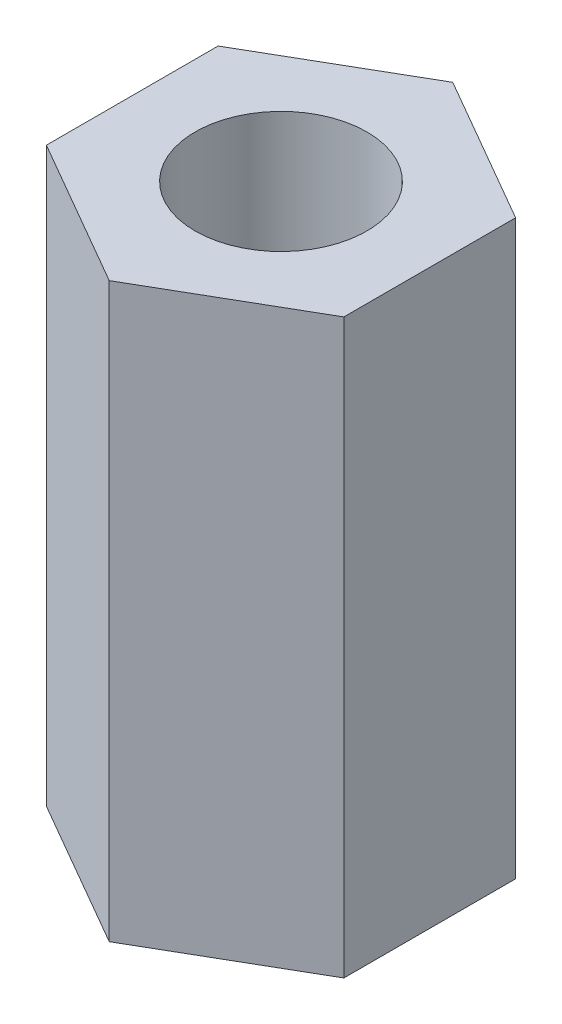
ISO-10303-21;
HEADER;
FILE_DESCRIPTION(('STEP AP214'),'2;1');
FILE_NAME('part.step','',(''),(''),'','','');
FILE_SCHEMA(('AUTOMOTIVE_DESIGN { 1 0 10303 214 1 1 1 1 }'));
ENDSEC;
DATA;
#1=APPLICATION_CONTEXT('core data for automotive mechanical design processes');
#2=APPLICATION_PROTOCOL_DEFINITION('international standard','automotive_design',2000,#1);
#3=PRODUCT_CONTEXT('',#1,'mechanical');
#4=PRODUCT('Part','Part','',(#3));
#5=PRODUCT_RELATED_PRODUCT_CATEGORY('part','',(#4));
#6=PRODUCT_DEFINITION_FORMATION('','',#4);
#7=PRODUCT_DEFINITION_CONTEXT('part definition',#1,'design');
#8=PRODUCT_DEFINITION('design','',#6,#7);
#9=PRODUCT_DEFINITION_SHAPE('','',#8);
#10=(LENGTH_UNIT() NAMED_UNIT(*) SI_UNIT(.MILLI.,.METRE.));
#11=(NAMED_UNIT(*) PLANE_ANGLE_UNIT() SI_UNIT($,.RADIAN.));
#12=(NAMED_UNIT(*) SI_UNIT($,.STERADIAN.) SOLID_ANGLE_UNIT());
#13=UNCERTAINTY_MEASURE_WITH_UNIT(LENGTH_MEASURE(1.E-05),#10,'distance_accuracy_value','');
#14=(GEOMETRIC_REPRESENTATION_CONTEXT(3) GLOBAL_UNCERTAINTY_ASSIGNED_CONTEXT((#13)) GLOBAL_UNIT_ASSIGNED_CONTEXT((#10,
#11,#12)) REPRESENTATION_CONTEXT('',''));
#15=CARTESIAN_POINT('',(0.,0.,0.));
#16=DIRECTION('',(0.,0.,1.));
#17=DIRECTION('',(1.,0.,0.));
#18=AXIS2_PLACEMENT_3D('',#15,#16,#17);
#19=CARTESIAN_POINT('',(0.,10.,-3.));
#20=DIRECTION('',(0.,1.,0.));
#21=DIRECTION('',(0.,0.,1.));
#22=AXIS2_PLACEMENT_3D('',#19,#20,#21);
#23=PLANE('',#22);
#24=DIRECTION('',(-0.866025403784439,0.,-0.5));
#25=VECTOR('',#24,1.);
#26=CARTESIAN_POINT('',(2.59807621135332,10.,-1.5));
#27=LINE('',#26,#25);
#28=CARTESIAN_POINT('',(2.59807621135332,10.,-1.5));
#29=VERTEX_POINT('',#28);
#30=CARTESIAN_POINT('',(0.,10.,-3.));
#31=VERTEX_POINT('',#30);
#32=EDGE_CURVE('E127',#29,#31,#27,.T.);
#33=ORIENTED_EDGE('',*,*,#32,.T.);
#34=DIRECTION('',(-0.866025403784439,0.,0.5));
#35=VECTOR('',#34,1.);
#36=CARTESIAN_POINT('',(0.,10.,-3.));
#37=LINE('',#36,#35);
#38=CARTESIAN_POINT('',(-2.59807621135332,10.,-1.5));
#39=VERTEX_POINT('',#38);
#40=EDGE_CURVE('E85',#31,#39,#37,.T.);
#41=ORIENTED_EDGE('',*,*,#40,.T.);
#42=DIRECTION('',(0.,0.,1.));
#43=VECTOR('',#42,1.);
#44=CARTESIAN_POINT('',(-2.59807621135332,10.,-1.5));
#45=LINE('',#44,#43);
#46=CARTESIAN_POINT('',(-2.59807621135332,10.,1.5));
#47=VERTEX_POINT('',#46);
#48=EDGE_CURVE('E98',#39,#47,#45,.T.);
#49=ORIENTED_EDGE('',*,*,#48,.T.);
#50=DIRECTION('',(0.866025403784439,0.,0.5));
#51=VECTOR('',#50,1.);
#52=CARTESIAN_POINT('',(-2.59807621135332,10.,1.5));
#53=LINE('',#52,#51);
#54=CARTESIAN_POINT('',(0.,10.,3.));
#55=VERTEX_POINT('',#54);
#56=EDGE_CURVE('E92',#47,#55,#53,.T.);
#57=ORIENTED_EDGE('',*,*,#56,.T.);
#58=DIRECTION('',(0.866025403784439,0.,-0.5));
#59=VECTOR('',#58,1.);
#60=CARTESIAN_POINT('',(0.,10.,3.));
#61=LINE('',#60,#59);
#62=CARTESIAN_POINT('',(2.59807621135332,10.,1.5));
#63=VERTEX_POINT('',#62);
#64=EDGE_CURVE('E96',#55,#63,#61,.T.);
#65=ORIENTED_EDGE('',*,*,#64,.T.);
#66=DIRECTION('',(0.,0.,-1.));
#67=VECTOR('',#66,1.);
#68=CARTESIAN_POINT('',(2.59807621135332,10.,1.5));
#69=LINE('',#68,#67);
#70=EDGE_CURVE('E48',#63,#29,#69,.T.);
#71=ORIENTED_EDGE('',*,*,#70,.T.);
#72=EDGE_LOOP('',(#33,#41,#49,#57,#65,#71));
#73=FACE_BOUND('',#72,.T.);
#74=CARTESIAN_POINT('',(0.,10.,0.));
#75=DIRECTION('',(0.,1.,0.));
#76=DIRECTION('',(0.,0.,1.));
#77=AXIS2_PLACEMENT_3D('',#74,#75,#76);
#78=CIRCLE('',#77,1.5);
#79=CARTESIAN_POINT('',(0.,10.,1.5));
#80=VERTEX_POINT('',#79);
#81=EDGE_CURVE('E120',#80,#80,#78,.T.);
#82=ORIENTED_EDGE('',*,*,#81,.F.);
#83=EDGE_LOOP('',(#82));
#84=FACE_BOUND('',#83,.T.);
#85=ADVANCED_FACE('F31',(#73,#84),#23,.T.);
#86=CARTESIAN_POINT('',(0.,0.,-3.));
#87=DIRECTION('',(0.,1.,0.));
#88=DIRECTION('',(0.,0.,1.));
#89=AXIS2_PLACEMENT_3D('',#86,#87,#88);
#90=PLANE('',#89);
#91=DIRECTION('',(-0.866025403784439,0.,-0.5));
#92=VECTOR('',#91,1.);
#93=CARTESIAN_POINT('',(2.59807621135332,0.,-1.5));
#94=LINE('',#93,#92);
#95=CARTESIAN_POINT('',(2.59807621135332,0.,-1.5));
#96=VERTEX_POINT('',#95);
#97=CARTESIAN_POINT('',(0.,0.,-3.));
#98=VERTEX_POINT('',#97);
#99=EDGE_CURVE('E116',#96,#98,#94,.T.);
#100=ORIENTED_EDGE('',*,*,#99,.F.);
#101=DIRECTION('',(0.,0.,-1.));
#102=VECTOR('',#101,1.);
#103=CARTESIAN_POINT('',(2.59807621135332,0.,1.5));
#104=LINE('',#103,#102);
#105=CARTESIAN_POINT('',(2.59807621135332,0.,1.5));
#106=VERTEX_POINT('',#105);
#107=EDGE_CURVE('E77',#106,#96,#104,.T.);
#108=ORIENTED_EDGE('',*,*,#107,.F.);
#109=DIRECTION('',(0.866025403784439,0.,-0.5));
#110=VECTOR('',#109,1.);
#111=CARTESIAN_POINT('',(0.,0.,3.));
#112=LINE('',#111,#110);
#113=CARTESIAN_POINT('',(0.,0.,3.));
#114=VERTEX_POINT('',#113);
#115=EDGE_CURVE('E71',#114,#106,#112,.T.);
#116=ORIENTED_EDGE('',*,*,#115,.F.);
#117=DIRECTION('',(0.866025403784439,0.,0.5));
#118=VECTOR('',#117,1.);
#119=CARTESIAN_POINT('',(-2.59807621135332,0.,1.5));
#120=LINE('',#119,#118);
#121=CARTESIAN_POINT('',(-2.59807621135332,0.,1.5));
#122=VERTEX_POINT('',#121);
#123=EDGE_CURVE('E106',#122,#114,#120,.T.);
#124=ORIENTED_EDGE('',*,*,#123,.F.);
#125=DIRECTION('',(0.,0.,1.));
#126=VECTOR('',#125,1.);
#127=CARTESIAN_POINT('',(-2.59807621135332,0.,-1.5));
#128=LINE('',#127,#126);
#129=CARTESIAN_POINT('',(-2.59807621135332,0.,-1.5));
#130=VERTEX_POINT('',#129);
#131=EDGE_CURVE('E122',#130,#122,#128,.T.);
#132=ORIENTED_EDGE('',*,*,#131,.F.);
#133=DIRECTION('',(-0.866025403784439,0.,0.5));
#134=VECTOR('',#133,1.);
#135=CARTESIAN_POINT('',(0.,0.,-3.));
#136=LINE('',#135,#134);
#137=EDGE_CURVE('E119',#98,#130,#136,.T.);
#138=ORIENTED_EDGE('',*,*,#137,.F.);
#139=EDGE_LOOP('',(#100,#108,#116,#124,#132,#138));
#140=FACE_BOUND('',#139,.T.);
#141=CARTESIAN_POINT('',(0.,0.,0.));
#142=DIRECTION('',(0.,1.,0.));
#143=DIRECTION('',(0.,0.,1.));
#144=AXIS2_PLACEMENT_3D('',#141,#142,#143);
#145=CIRCLE('',#144,1.5);
#146=CARTESIAN_POINT('',(0.,0.,1.5));
#147=VERTEX_POINT('',#146);
#148=EDGE_CURVE('E220',#147,#147,#145,.T.);
#149=ORIENTED_EDGE('',*,*,#148,.T.);
#150=EDGE_LOOP('',(#149));
#151=FACE_BOUND('',#150,.T.);
#152=ADVANCED_FACE('F136',(#140,#151),#90,.F.);
#153=CARTESIAN_POINT('',(2.59807621135332,10.,-1.5));
#154=DIRECTION('',(-0.5,0.,0.866025403784439));
#155=DIRECTION('',(0.866025403784439,0.,0.5));
#156=AXIS2_PLACEMENT_3D('',#153,#154,#155);
#157=PLANE('',#156);
#158=ORIENTED_EDGE('',*,*,#99,.T.);
#159=DIRECTION('',(0.,-1.,0.));
#160=VECTOR('',#159,1.);
#161=CARTESIAN_POINT('',(0.,10.,-3.));
#162=LINE('',#161,#160);
#163=EDGE_CURVE('E11',#31,#98,#162,.T.);
#164=ORIENTED_EDGE('',*,*,#163,.F.);
#165=ORIENTED_EDGE('',*,*,#32,.F.);
#166=DIRECTION('',(0.,-1.,0.));
#167=VECTOR('',#166,1.);
#168=CARTESIAN_POINT('',(2.59807621135332,10.,-1.5));
#169=LINE('',#168,#167);
#170=EDGE_CURVE('E112',#29,#96,#169,.T.);
#171=ORIENTED_EDGE('',*,*,#170,.T.);
#172=EDGE_LOOP('',(#158,#164,#165,#171));
#173=FACE_BOUND('',#172,.T.);
#174=ADVANCED_FACE('F33',(#173),#157,.F.);
#175=CARTESIAN_POINT('',(0.,10.,-3.));
#176=DIRECTION('',(0.5,0.,0.866025403784439));
#177=DIRECTION('',(0.866025403784439,0.,-0.5));
#178=AXIS2_PLACEMENT_3D('',#175,#176,#177);
#179=PLANE('',#178);
#180=ORIENTED_EDGE('',*,*,#137,.T.);
#181=DIRECTION('',(0.,-1.,0.));
#182=VECTOR('',#181,1.);
#183=CARTESIAN_POINT('',(-2.59807621135332,10.,-1.5));
#184=LINE('',#183,#182);
#185=EDGE_CURVE('E40',#39,#130,#184,.T.);
#186=ORIENTED_EDGE('',*,*,#185,.F.);
#187=ORIENTED_EDGE('',*,*,#40,.F.);
#188=ORIENTED_EDGE('',*,*,#163,.T.);
#189=EDGE_LOOP('',(#180,#186,#187,#188));
#190=FACE_BOUND('',#189,.T.);
#191=ADVANCED_FACE('F161',(#190),#179,.F.);
#192=CARTESIAN_POINT('',(-2.59807621135332,10.,-1.5));
#193=DIRECTION('',(1.,0.,0.));
#194=DIRECTION('',(0.,0.,-1.));
#195=AXIS2_PLACEMENT_3D('',#192,#193,#194);
#196=PLANE('',#195);
#197=ORIENTED_EDGE('',*,*,#131,.T.);
#198=DIRECTION('',(0.,-1.,0.));
#199=VECTOR('',#198,1.);
#200=CARTESIAN_POINT('',(-2.59807621135332,10.,1.5));
#201=LINE('',#200,#199);
#202=EDGE_CURVE('E107',#47,#122,#201,.T.);
#203=ORIENTED_EDGE('',*,*,#202,.F.);
#204=ORIENTED_EDGE('',*,*,#48,.F.);
#205=ORIENTED_EDGE('',*,*,#185,.T.);
#206=EDGE_LOOP('',(#197,#203,#204,#205));
#207=FACE_BOUND('',#206,.T.);
#208=ADVANCED_FACE('F133',(#207),#196,.F.);
#209=CARTESIAN_POINT('',(-2.59807621135332,10.,1.5));
#210=DIRECTION('',(0.5,0.,-0.866025403784439));
#211=DIRECTION('',(-0.866025403784439,0.,-0.5));
#212=AXIS2_PLACEMENT_3D('',#209,#210,#211);
#213=PLANE('',#212);
#214=ORIENTED_EDGE('',*,*,#123,.T.);
#215=DIRECTION('',(0.,-1.,0.));
#216=VECTOR('',#215,1.);
#217=CARTESIAN_POINT('',(0.,10.,3.));
#218=LINE('',#217,#216);
#219=EDGE_CURVE('E103',#55,#114,#218,.T.);
#220=ORIENTED_EDGE('',*,*,#219,.F.);
#221=ORIENTED_EDGE('',*,*,#56,.F.);
#222=ORIENTED_EDGE('',*,*,#202,.T.);
#223=EDGE_LOOP('',(#214,#220,#221,#222));
#224=FACE_BOUND('',#223,.T.);
#225=ADVANCED_FACE('F104',(#224),#213,.F.);
#226=CARTESIAN_POINT('',(0.,10.,3.));
#227=DIRECTION('',(-0.5,0.,-0.866025403784439));
#228=DIRECTION('',(-0.866025403784439,0.,0.5));
#229=AXIS2_PLACEMENT_3D('',#226,#227,#228);
#230=PLANE('',#229);
#231=ORIENTED_EDGE('',*,*,#115,.T.);
#232=DIRECTION('',(0.,-1.,0.));
#233=VECTOR('',#232,1.);
#234=CARTESIAN_POINT('',(2.59807621135332,10.,1.5));
#235=LINE('',#234,#233);
#236=EDGE_CURVE('E108',#63,#106,#235,.T.);
#237=ORIENTED_EDGE('',*,*,#236,.F.);
#238=ORIENTED_EDGE('',*,*,#64,.F.);
#239=ORIENTED_EDGE('',*,*,#219,.T.);
#240=EDGE_LOOP('',(#231,#237,#238,#239));
#241=FACE_BOUND('',#240,.T.);
#242=ADVANCED_FACE('F110',(#241),#230,.F.);
#243=CARTESIAN_POINT('',(2.59807621135332,10.,1.5));
#244=DIRECTION('',(-1.,0.,0.));
#245=DIRECTION('',(0.,0.,1.));
#246=AXIS2_PLACEMENT_3D('',#243,#244,#245);
#247=PLANE('',#246);
#248=ORIENTED_EDGE('',*,*,#107,.T.);
#249=ORIENTED_EDGE('',*,*,#170,.F.);
#250=ORIENTED_EDGE('',*,*,#70,.F.);
#251=ORIENTED_EDGE('',*,*,#236,.T.);
#252=EDGE_LOOP('',(#248,#249,#250,#251));
#253=FACE_BOUND('',#252,.T.);
#254=ADVANCED_FACE('F141',(#253),#247,.F.);
#255=CARTESIAN_POINT('',(0.,10.,0.));
#256=DIRECTION('',(0.,-1.,0.));
#257=DIRECTION('',(0.,0.,-1.));
#258=AXIS2_PLACEMENT_3D('',#255,#256,#257);
#259=CYLINDRICAL_SURFACE('',#258,1.5);
#260=ORIENTED_EDGE('',*,*,#81,.T.);
#261=EDGE_LOOP('',(#260));
#262=FACE_BOUND('',#261,.T.);
#263=ORIENTED_EDGE('',*,*,#148,.F.);
#264=EDGE_LOOP('',(#263));
#265=FACE_BOUND('',#264,.T.);
#266=ADVANCED_FACE('F143',(#262,#265),#259,.F.);
#267=CLOSED_SHELL('',(#85,#152,#174,#191,#208,#225,#242,#254,#266));
#268=MANIFOLD_SOLID_BREP('B2',#267);
#269=ADVANCED_BREP_SHAPE_REPRESENTATION('',(#18,#268),#14);
#270=SHAPE_DEFINITION_REPRESENTATION(#9,#269);
ENDSEC;
END-ISO-10303-21;
